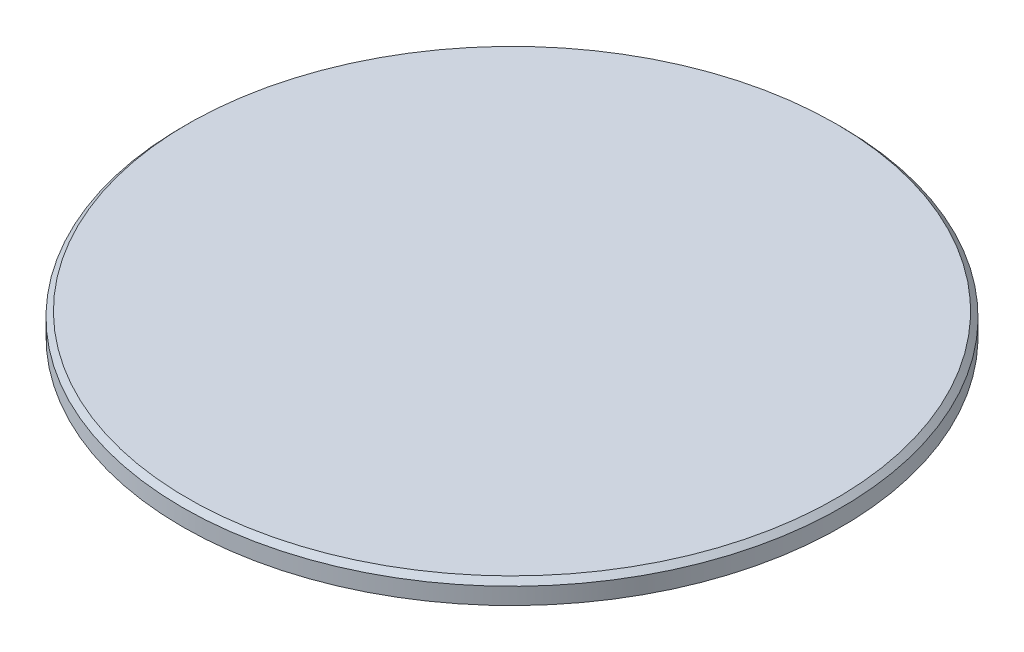
ISO-10303-21;
HEADER;
FILE_DESCRIPTION(('STEP AP214'),'2;1');
FILE_NAME('part.step','',(''),(''),'','','');
FILE_SCHEMA(('AUTOMOTIVE_DESIGN { 1 0 10303 214 1 1 1 1 }'));
ENDSEC;
DATA;
#1=APPLICATION_CONTEXT('core data for automotive mechanical design processes');
#2=APPLICATION_PROTOCOL_DEFINITION('international standard','automotive_design',2000,#1);
#3=PRODUCT_CONTEXT('',#1,'mechanical');
#4=PRODUCT('Part','Part','',(#3));
#5=PRODUCT_RELATED_PRODUCT_CATEGORY('part','',(#4));
#6=PRODUCT_DEFINITION_FORMATION('','',#4);
#7=PRODUCT_DEFINITION_CONTEXT('part definition',#1,'design');
#8=PRODUCT_DEFINITION('design','',#6,#7);
#9=PRODUCT_DEFINITION_SHAPE('','',#8);
#10=(LENGTH_UNIT() NAMED_UNIT(*) SI_UNIT(.MILLI.,.METRE.));
#11=(NAMED_UNIT(*) PLANE_ANGLE_UNIT() SI_UNIT($,.RADIAN.));
#12=(NAMED_UNIT(*) SI_UNIT($,.STERADIAN.) SOLID_ANGLE_UNIT());
#13=UNCERTAINTY_MEASURE_WITH_UNIT(LENGTH_MEASURE(1.E-05),#10,'distance_accuracy_value','');
#14=(GEOMETRIC_REPRESENTATION_CONTEXT(3) GLOBAL_UNCERTAINTY_ASSIGNED_CONTEXT((#13)) GLOBAL_UNIT_ASSIGNED_CONTEXT((#10,
#11,#12)) REPRESENTATION_CONTEXT('',''));
#15=CARTESIAN_POINT('',(0.,0.,0.));
#16=DIRECTION('',(0.,0.,1.));
#17=DIRECTION('',(1.,0.,0.));
#18=AXIS2_PLACEMENT_3D('',#15,#16,#17);
#19=CARTESIAN_POINT('',(0.,0.,0.));
#20=DIRECTION('',(0.,-1.,0.));
#21=DIRECTION('',(0.,0.,-1.));
#22=AXIS2_PLACEMENT_3D('',#19,#20,#21);
#23=PLANE('',#22);
#24=CARTESIAN_POINT('',(0.,0.,0.));
#25=DIRECTION('',(0.,-1.,0.));
#26=DIRECTION('',(0.,0.,-1.));
#27=AXIS2_PLACEMENT_3D('',#24,#25,#26);
#28=CIRCLE('',#27,36.9);
#29=CARTESIAN_POINT('',(0.,0.,-36.9));
#30=VERTEX_POINT('',#29);
#31=EDGE_CURVE('E45',#30,#30,#28,.F.);
#32=ORIENTED_EDGE('',*,*,#31,.T.);
#33=EDGE_LOOP('',(#32));
#34=FACE_BOUND('',#33,.T.);
#35=ADVANCED_FACE('F33',(#34),#23,.F.);
#36=CARTESIAN_POINT('',(0.,0.,0.));
#37=DIRECTION('',(0.,-1.,0.));
#38=DIRECTION('',(0.,0.,-1.));
#39=AXIS2_PLACEMENT_3D('',#36,#37,#38);
#40=CYLINDRICAL_SURFACE('',#39,37.5);
#41=CARTESIAN_POINT('',(0.,-0.60000000000002,0.));
#42=DIRECTION('',(0.,-1.,0.));
#43=DIRECTION('',(0.,0.,-1.));
#44=AXIS2_PLACEMENT_3D('',#41,#42,#43);
#45=CIRCLE('',#44,37.5);
#46=CARTESIAN_POINT('',(0.,-0.60000000000002,-37.5));
#47=VERTEX_POINT('',#46);
#48=EDGE_CURVE('E49',#47,#47,#45,.T.);
#49=ORIENTED_EDGE('',*,*,#48,.T.);
#50=EDGE_LOOP('',(#49));
#51=FACE_BOUND('',#50,.T.);
#52=CARTESIAN_POINT('',(0.,-2.5,0.));
#53=DIRECTION('',(0.,-1.,0.));
#54=DIRECTION('',(0.,0.,-1.));
#55=AXIS2_PLACEMENT_3D('',#52,#53,#54);
#56=CIRCLE('',#55,37.5);
#57=CARTESIAN_POINT('',(0.,-2.5,-37.5));
#58=VERTEX_POINT('',#57);
#59=EDGE_CURVE('E54',#58,#58,#56,.T.);
#60=ORIENTED_EDGE('',*,*,#59,.F.);
#61=EDGE_LOOP('',(#60));
#62=FACE_BOUND('',#61,.T.);
#63=ADVANCED_FACE('F116',(#51,#62),#40,.T.);
#64=CARTESIAN_POINT('',(-37.5,-2.5,0.));
#65=DIRECTION('',(0.,1.,0.));
#66=DIRECTION('',(0.,0.,1.));
#67=AXIS2_PLACEMENT_3D('',#64,#65,#66);
#68=PLANE('',#67);
#69=CARTESIAN_POINT('',(-15.5000000000003,-2.5,-26.8467875173174));
#70=DIRECTION('',(0.,-1.,0.));
#71=DIRECTION('',(0.866025403784433,0.,-0.50000000000001));
#72=AXIS2_PLACEMENT_3D('',#69,#70,#71);
#73=CIRCLE('',#72,4.);
#74=CARTESIAN_POINT('',(-12.0358983848626,-2.5,-28.8467875173175));
#75=VERTEX_POINT('',#74);
#76=EDGE_CURVE('E79',#75,#75,#73,.T.);
#77=ORIENTED_EDGE('',*,*,#76,.F.);
#78=EDGE_LOOP('',(#77));
#79=FACE_BOUND('',#78,.T.);
#80=CARTESIAN_POINT('',(15.4999999999997,-2.5,-26.8467875173177));
#81=DIRECTION('',(0.,-1.,0.));
#82=DIRECTION('',(0.866025403784443,0.,0.499999999999992));
#83=AXIS2_PLACEMENT_3D('',#80,#81,#82);
#84=CIRCLE('',#83,4.);
#85=CARTESIAN_POINT('',(18.9641016151375,-2.5,-24.8467875173178));
#86=VERTEX_POINT('',#85);
#87=EDGE_CURVE('E85',#86,#86,#84,.T.);
#88=ORIENTED_EDGE('',*,*,#87,.F.);
#89=EDGE_LOOP('',(#88));
#90=FACE_BOUND('',#89,.T.);
#91=CARTESIAN_POINT('',(31.,-2.5,0.));
#92=DIRECTION('',(0.,-1.,0.));
#93=DIRECTION('',(0.,0.,1.));
#94=AXIS2_PLACEMENT_3D('',#91,#92,#93);
#95=CIRCLE('',#94,4.);
#96=CARTESIAN_POINT('',(31.,-2.5,4.));
#97=VERTEX_POINT('',#96);
#98=EDGE_CURVE('E91',#97,#97,#95,.T.);
#99=ORIENTED_EDGE('',*,*,#98,.F.);
#100=EDGE_LOOP('',(#99));
#101=FACE_BOUND('',#100,.T.);
#102=CARTESIAN_POINT('',(15.5000000000001,-2.5,26.8467875173175));
#103=DIRECTION('',(0.,-1.,0.));
#104=DIRECTION('',(-0.866025403784436,0.,0.500000000000004));
#105=AXIS2_PLACEMENT_3D('',#102,#103,#104);
#106=CIRCLE('',#105,4.);
#107=CARTESIAN_POINT('',(12.0358983848624,-2.5,28.8467875173175));
#108=VERTEX_POINT('',#107);
#109=EDGE_CURVE('E97',#108,#108,#106,.T.);
#110=ORIENTED_EDGE('',*,*,#109,.F.);
#111=EDGE_LOOP('',(#110));
#112=FACE_BOUND('',#111,.T.);
#113=CARTESIAN_POINT('',(-15.4999999999999,-2.5,26.8467875173176));
#114=DIRECTION('',(0.,-1.,0.));
#115=DIRECTION('',(-0.86602540378444,0.,-0.499999999999998));
#116=AXIS2_PLACEMENT_3D('',#113,#114,#115);
#117=CIRCLE('',#116,4.);
#118=CARTESIAN_POINT('',(-18.9641016151377,-2.5,24.8467875173176));
#119=VERTEX_POINT('',#118);
#120=EDGE_CURVE('E73',#119,#119,#117,.T.);
#121=ORIENTED_EDGE('',*,*,#120,.F.);
#122=EDGE_LOOP('',(#121));
#123=FACE_BOUND('',#122,.T.);
#124=CARTESIAN_POINT('',(-31.,-2.5,0.));
#125=DIRECTION('',(0.,-1.,0.));
#126=DIRECTION('',(0.,0.,-1.));
#127=AXIS2_PLACEMENT_3D('',#124,#125,#126);
#128=CIRCLE('',#127,4.);
#129=CARTESIAN_POINT('',(-31.,-2.5,-4.));
#130=VERTEX_POINT('',#129);
#131=EDGE_CURVE('E67',#130,#130,#128,.T.);
#132=ORIENTED_EDGE('',*,*,#131,.F.);
#133=EDGE_LOOP('',(#132));
#134=FACE_BOUND('',#133,.T.);
#135=CARTESIAN_POINT('',(0.,-2.5,0.));
#136=DIRECTION('',(0.,-1.,0.));
#137=DIRECTION('',(0.,0.,-1.));
#138=AXIS2_PLACEMENT_3D('',#135,#136,#137);
#139=CIRCLE('',#138,24.65);
#140=CARTESIAN_POINT('',(0.,-2.5,-24.65));
#141=VERTEX_POINT('',#140);
#142=EDGE_CURVE('E57',#141,#141,#139,.T.);
#143=ORIENTED_EDGE('',*,*,#142,.F.);
#144=EDGE_LOOP('',(#143));
#145=FACE_BOUND('',#144,.T.);
#146=ORIENTED_EDGE('',*,*,#59,.T.);
#147=EDGE_LOOP('',(#146));
#148=FACE_BOUND('',#147,.T.);
#149=ADVANCED_FACE('F112',(#79,#90,#101,#112,#123,#134,#145,#148),#68,.F.);
#150=CARTESIAN_POINT('',(0.,0.,0.));
#151=DIRECTION('',(0.,-1.,0.));
#152=DIRECTION('',(0.,0.,-1.));
#153=AXIS2_PLACEMENT_3D('',#150,#151,#152);
#154=CYLINDRICAL_SURFACE('',#153,24.65);
#155=CARTESIAN_POINT('',(0.,-4.89999999999997,0.));
#156=DIRECTION('',(0.,1.,0.));
#157=DIRECTION('',(0.,0.,1.));
#158=AXIS2_PLACEMENT_3D('',#155,#156,#157);
#159=CIRCLE('',#158,24.65);
#160=CARTESIAN_POINT('',(0.,-4.89999999999997,24.65));
#161=VERTEX_POINT('',#160);
#162=EDGE_CURVE('E10',#161,#161,#159,.T.);
#163=ORIENTED_EDGE('',*,*,#162,.T.);
#164=EDGE_LOOP('',(#163));
#165=FACE_BOUND('',#164,.T.);
#166=ORIENTED_EDGE('',*,*,#142,.T.);
#167=EDGE_LOOP('',(#166));
#168=FACE_BOUND('',#167,.T.);
#169=ADVANCED_FACE('F115',(#165,#168),#154,.T.);
#170=CARTESIAN_POINT('',(-24.65,-5.50000000000001,0.));
#171=DIRECTION('',(0.,1.,0.));
#172=DIRECTION('',(0.,0.,1.));
#173=AXIS2_PLACEMENT_3D('',#170,#171,#172);
#174=PLANE('',#173);
#175=CARTESIAN_POINT('',(0.,-5.50000000000001,0.));
#176=DIRECTION('',(0.,1.,0.));
#177=DIRECTION('',(0.,0.,1.));
#178=AXIS2_PLACEMENT_3D('',#175,#176,#177);
#179=CIRCLE('',#178,24.05);
#180=CARTESIAN_POINT('',(0.,-5.50000000000001,24.05));
#181=VERTEX_POINT('',#180);
#182=EDGE_CURVE('E41',#181,#181,#179,.F.);
#183=ORIENTED_EDGE('',*,*,#182,.T.);
#184=EDGE_LOOP('',(#183));
#185=FACE_BOUND('',#184,.T.);
#186=CARTESIAN_POINT('',(0.,-5.50000000000001,0.));
#187=DIRECTION('',(0.,-1.,0.));
#188=DIRECTION('',(0.,0.,-1.));
#189=AXIS2_PLACEMENT_3D('',#186,#187,#188);
#190=CIRCLE('',#189,20.);
#191=CARTESIAN_POINT('',(0.,-5.50000000000001,-20.));
#192=VERTEX_POINT('',#191);
#193=EDGE_CURVE('E60',#192,#192,#190,.T.);
#194=ORIENTED_EDGE('',*,*,#193,.F.);
#195=EDGE_LOOP('',(#194));
#196=FACE_BOUND('',#195,.T.);
#197=ADVANCED_FACE('F186',(#185,#196),#174,.F.);
#198=CARTESIAN_POINT('',(0.,0.,0.));
#199=DIRECTION('',(0.,-1.,0.));
#200=DIRECTION('',(0.,0.,-1.));
#201=AXIS2_PLACEMENT_3D('',#198,#199,#200);
#202=CYLINDRICAL_SURFACE('',#201,20.);
#203=CARTESIAN_POINT('',(0.,-2.5,0.));
#204=DIRECTION('',(0.,-1.,0.));
#205=DIRECTION('',(0.,0.,-1.));
#206=AXIS2_PLACEMENT_3D('',#203,#204,#205);
#207=CIRCLE('',#206,20.);
#208=CARTESIAN_POINT('',(0.,-2.5,-20.));
#209=VERTEX_POINT('',#208);
#210=EDGE_CURVE('E63',#209,#209,#207,.T.);
#211=ORIENTED_EDGE('',*,*,#210,.F.);
#212=EDGE_LOOP('',(#211));
#213=FACE_BOUND('',#212,.T.);
#214=ORIENTED_EDGE('',*,*,#193,.T.);
#215=EDGE_LOOP('',(#214));
#216=FACE_BOUND('',#215,.T.);
#217=ADVANCED_FACE('F182',(#213,#216),#202,.F.);
#218=CARTESIAN_POINT('',(-20.,-2.5,0.));
#219=DIRECTION('',(0.,1.,0.));
#220=DIRECTION('',(0.,0.,1.));
#221=AXIS2_PLACEMENT_3D('',#218,#219,#220);
#222=PLANE('',#221);
#223=ORIENTED_EDGE('',*,*,#210,.T.);
#224=EDGE_LOOP('',(#223));
#225=FACE_BOUND('',#224,.T.);
#226=ADVANCED_FACE('F178',(#225),#222,.F.);
#227=CARTESIAN_POINT('',(-31.,-0.500000000000005,0.));
#228=DIRECTION('',(0.,-1.,0.));
#229=DIRECTION('',(0.,0.,-1.));
#230=AXIS2_PLACEMENT_3D('',#227,#228,#229);
#231=CYLINDRICAL_SURFACE('',#230,4.);
#232=CARTESIAN_POINT('',(-31.,-0.500000000000005,0.));
#233=DIRECTION('',(0.,-1.,0.));
#234=DIRECTION('',(0.,0.,-1.));
#235=AXIS2_PLACEMENT_3D('',#232,#233,#234);
#236=CIRCLE('',#235,4.);
#237=CARTESIAN_POINT('',(-31.,-0.500000000000005,-4.));
#238=VERTEX_POINT('',#237);
#239=EDGE_CURVE('E66',#238,#238,#236,.T.);
#240=ORIENTED_EDGE('',*,*,#239,.F.);
#241=EDGE_LOOP('',(#240));
#242=FACE_BOUND('',#241,.T.);
#243=ORIENTED_EDGE('',*,*,#131,.T.);
#244=EDGE_LOOP('',(#243));
#245=FACE_BOUND('',#244,.T.);
#246=ADVANCED_FACE('F174',(#242,#245),#231,.F.);
#247=CARTESIAN_POINT('',(-31.,-0.500000000000005,0.));
#248=DIRECTION('',(0.,-1.,0.));
#249=DIRECTION('',(0.,0.,-1.));
#250=AXIS2_PLACEMENT_3D('',#247,#248,#249);
#251=PLANE('',#250);
#252=ORIENTED_EDGE('',*,*,#239,.T.);
#253=EDGE_LOOP('',(#252));
#254=FACE_BOUND('',#253,.T.);
#255=ADVANCED_FACE('F170',(#254),#251,.T.);
#256=CARTESIAN_POINT('',(-15.4999999999999,-0.500000000000005,26.8467875173176));
#257=DIRECTION('',(0.,-1.,0.));
#258=DIRECTION('',(0.,0.,-1.));
#259=AXIS2_PLACEMENT_3D('',#256,#257,#258);
#260=CYLINDRICAL_SURFACE('',#259,4.);
#261=CARTESIAN_POINT('',(-15.4999999999999,-0.500000000000005,26.8467875173176));
#262=DIRECTION('',(0.,-1.,0.));
#263=DIRECTION('',(-0.86602540378444,0.,-0.499999999999998));
#264=AXIS2_PLACEMENT_3D('',#261,#262,#263);
#265=CIRCLE('',#264,4.);
#266=CARTESIAN_POINT('',(-18.9641016151377,-0.500000000000005,24.8467875173176));
#267=VERTEX_POINT('',#266);
#268=EDGE_CURVE('E70',#267,#267,#265,.T.);
#269=ORIENTED_EDGE('',*,*,#268,.F.);
#270=EDGE_LOOP('',(#269));
#271=FACE_BOUND('',#270,.T.);
#272=ORIENTED_EDGE('',*,*,#120,.T.);
#273=EDGE_LOOP('',(#272));
#274=FACE_BOUND('',#273,.T.);
#275=ADVANCED_FACE('F166',(#271,#274),#260,.F.);
#276=CARTESIAN_POINT('',(-15.4999999999999,-0.500000000000005,26.8467875173176));
#277=DIRECTION('',(0.,-1.,0.));
#278=DIRECTION('',(-0.86602540378444,0.,-0.499999999999998));
#279=AXIS2_PLACEMENT_3D('',#276,#277,#278);
#280=PLANE('',#279);
#281=ORIENTED_EDGE('',*,*,#268,.T.);
#282=EDGE_LOOP('',(#281));
#283=FACE_BOUND('',#282,.T.);
#284=ADVANCED_FACE('F108',(#283),#280,.T.);
#285=CARTESIAN_POINT('',(15.5000000000001,-0.500000000000005,26.8467875173175));
#286=DIRECTION('',(0.,-1.,0.));
#287=DIRECTION('',(0.,0.,-1.));
#288=AXIS2_PLACEMENT_3D('',#285,#286,#287);
#289=CYLINDRICAL_SURFACE('',#288,4.);
#290=CARTESIAN_POINT('',(15.5000000000001,-0.500000000000005,26.8467875173175));
#291=DIRECTION('',(0.,-1.,0.));
#292=DIRECTION('',(-0.866025403784436,0.,0.500000000000004));
#293=AXIS2_PLACEMENT_3D('',#290,#291,#292);
#294=CIRCLE('',#293,4.);
#295=CARTESIAN_POINT('',(12.0358983848624,-0.500000000000005,28.8467875173175));
#296=VERTEX_POINT('',#295);
#297=EDGE_CURVE('E76',#296,#296,#294,.T.);
#298=ORIENTED_EDGE('',*,*,#297,.F.);
#299=EDGE_LOOP('',(#298));
#300=FACE_BOUND('',#299,.T.);
#301=ORIENTED_EDGE('',*,*,#109,.T.);
#302=EDGE_LOOP('',(#301));
#303=FACE_BOUND('',#302,.T.);
#304=ADVANCED_FACE('F105',(#300,#303),#289,.F.);
#305=CARTESIAN_POINT('',(15.5000000000001,-0.500000000000005,26.8467875173175));
#306=DIRECTION('',(0.,-1.,0.));
#307=DIRECTION('',(-0.866025403784436,0.,0.500000000000004));
#308=AXIS2_PLACEMENT_3D('',#305,#306,#307);
#309=PLANE('',#308);
#310=ORIENTED_EDGE('',*,*,#297,.T.);
#311=EDGE_LOOP('',(#310));
#312=FACE_BOUND('',#311,.T.);
#313=ADVANCED_FACE('F103',(#312),#309,.T.);
#314=CARTESIAN_POINT('',(31.,-0.500000000000005,0.));
#315=DIRECTION('',(0.,-1.,0.));
#316=DIRECTION('',(0.,0.,-1.));
#317=AXIS2_PLACEMENT_3D('',#314,#315,#316);
#318=CYLINDRICAL_SURFACE('',#317,4.);
#319=CARTESIAN_POINT('',(31.,-0.500000000000005,0.));
#320=DIRECTION('',(0.,-1.,0.));
#321=DIRECTION('',(0.,0.,1.));
#322=AXIS2_PLACEMENT_3D('',#319,#320,#321);
#323=CIRCLE('',#322,4.);
#324=CARTESIAN_POINT('',(31.,-0.500000000000005,4.));
#325=VERTEX_POINT('',#324);
#326=EDGE_CURVE('E94',#325,#325,#323,.T.);
#327=ORIENTED_EDGE('',*,*,#326,.F.);
#328=EDGE_LOOP('',(#327));
#329=FACE_BOUND('',#328,.T.);
#330=ORIENTED_EDGE('',*,*,#98,.T.);
#331=EDGE_LOOP('',(#330));
#332=FACE_BOUND('',#331,.T.);
#333=ADVANCED_FACE('F233',(#329,#332),#318,.F.);
#334=CARTESIAN_POINT('',(31.,-0.500000000000005,0.));
#335=DIRECTION('',(0.,-1.,0.));
#336=DIRECTION('',(0.,0.,1.));
#337=AXIS2_PLACEMENT_3D('',#334,#335,#336);
#338=PLANE('',#337);
#339=ORIENTED_EDGE('',*,*,#326,.T.);
#340=EDGE_LOOP('',(#339));
#341=FACE_BOUND('',#340,.T.);
#342=ADVANCED_FACE('F240',(#341),#338,.T.);
#343=CARTESIAN_POINT('',(15.4999999999997,-0.500000000000005,-26.8467875173177));
#344=DIRECTION('',(0.,-1.,0.));
#345=DIRECTION('',(0.,0.,-1.));
#346=AXIS2_PLACEMENT_3D('',#343,#344,#345);
#347=CYLINDRICAL_SURFACE('',#346,4.);
#348=CARTESIAN_POINT('',(15.4999999999997,-0.500000000000005,-26.8467875173177));
#349=DIRECTION('',(0.,-1.,0.));
#350=DIRECTION('',(0.866025403784443,0.,0.499999999999992));
#351=AXIS2_PLACEMENT_3D('',#348,#349,#350);
#352=CIRCLE('',#351,4.);
#353=CARTESIAN_POINT('',(18.9641016151375,-0.500000000000005,-24.8467875173178));
#354=VERTEX_POINT('',#353);
#355=EDGE_CURVE('E88',#354,#354,#352,.T.);
#356=ORIENTED_EDGE('',*,*,#355,.F.);
#357=EDGE_LOOP('',(#356));
#358=FACE_BOUND('',#357,.T.);
#359=ORIENTED_EDGE('',*,*,#87,.T.);
#360=EDGE_LOOP('',(#359));
#361=FACE_BOUND('',#360,.T.);
#362=ADVANCED_FACE('F161',(#358,#361),#347,.F.);
#363=CARTESIAN_POINT('',(15.4999999999997,-0.500000000000005,-26.8467875173177));
#364=DIRECTION('',(0.,-1.,0.));
#365=DIRECTION('',(0.866025403784443,0.,0.499999999999992));
#366=AXIS2_PLACEMENT_3D('',#363,#364,#365);
#367=PLANE('',#366);
#368=ORIENTED_EDGE('',*,*,#355,.T.);
#369=EDGE_LOOP('',(#368));
#370=FACE_BOUND('',#369,.T.);
#371=ADVANCED_FACE('F157',(#370),#367,.T.);
#372=CARTESIAN_POINT('',(-15.5000000000003,-0.500000000000005,-26.8467875173174));
#373=DIRECTION('',(0.,-1.,0.));
#374=DIRECTION('',(0.,0.,-1.));
#375=AXIS2_PLACEMENT_3D('',#372,#373,#374);
#376=CYLINDRICAL_SURFACE('',#375,4.);
#377=CARTESIAN_POINT('',(-15.5000000000003,-0.500000000000005,-26.8467875173174));
#378=DIRECTION('',(0.,-1.,0.));
#379=DIRECTION('',(0.866025403784433,0.,-0.50000000000001));
#380=AXIS2_PLACEMENT_3D('',#377,#378,#379);
#381=CIRCLE('',#380,4.);
#382=CARTESIAN_POINT('',(-12.0358983848626,-0.500000000000005,-28.8467875173175));
#383=VERTEX_POINT('',#382);
#384=EDGE_CURVE('E82',#383,#383,#381,.T.);
#385=ORIENTED_EDGE('',*,*,#384,.F.);
#386=EDGE_LOOP('',(#385));
#387=FACE_BOUND('',#386,.T.);
#388=ORIENTED_EDGE('',*,*,#76,.T.);
#389=EDGE_LOOP('',(#388));
#390=FACE_BOUND('',#389,.T.);
#391=ADVANCED_FACE('F148',(#387,#390),#376,.F.);
#392=CARTESIAN_POINT('',(-15.5000000000003,-0.500000000000005,-26.8467875173174));
#393=DIRECTION('',(0.,-1.,0.));
#394=DIRECTION('',(0.866025403784433,0.,-0.50000000000001));
#395=AXIS2_PLACEMENT_3D('',#392,#393,#394);
#396=PLANE('',#395);
#397=ORIENTED_EDGE('',*,*,#384,.T.);
#398=EDGE_LOOP('',(#397));
#399=FACE_BOUND('',#398,.T.);
#400=ADVANCED_FACE('F141',(#399),#396,.T.);
#401=CARTESIAN_POINT('',(0.,-0.60000000000002,0.));
#402=DIRECTION('',(0.,-1.,0.));
#403=DIRECTION('',(0.,0.,-1.));
#404=AXIS2_PLACEMENT_3D('',#401,#402,#403);
#405=CONICAL_SURFACE('',#404,37.5,0.785398163397448);
#406=ORIENTED_EDGE('',*,*,#31,.F.);
#407=EDGE_LOOP('',(#406));
#408=FACE_BOUND('',#407,.T.);
#409=ORIENTED_EDGE('',*,*,#48,.F.);
#410=EDGE_LOOP('',(#409));
#411=FACE_BOUND('',#410,.T.);
#412=ADVANCED_FACE('F137',(#408,#411),#405,.T.);
#413=CARTESIAN_POINT('',(0.,-5.50000000000001,0.));
#414=DIRECTION('',(0.,1.,0.));
#415=DIRECTION('',(0.,0.,1.));
#416=AXIS2_PLACEMENT_3D('',#413,#414,#415);
#417=CONICAL_SURFACE('',#416,24.05,0.785398163397431);
#418=ORIENTED_EDGE('',*,*,#162,.F.);
#419=EDGE_LOOP('',(#418));
#420=FACE_BOUND('',#419,.T.);
#421=ORIENTED_EDGE('',*,*,#182,.F.);
#422=EDGE_LOOP('',(#421));
#423=FACE_BOUND('',#422,.T.);
#424=ADVANCED_FACE('F36',(#420,#423),#417,.T.);
#425=CLOSED_SHELL('',(#35,#63,#149,#169,#197,#217,#226,#246,#255,#275,#284,#304,#313,#333,#342,
#362,#371,#391,#400,#412,#424));
#426=MANIFOLD_SOLID_BREP('B2',#425);
#427=ADVANCED_BREP_SHAPE_REPRESENTATION('',(#18,#426),#14);
#428=SHAPE_DEFINITION_REPRESENTATION(#9,#427);
ENDSEC;
END-ISO-10303-21;
